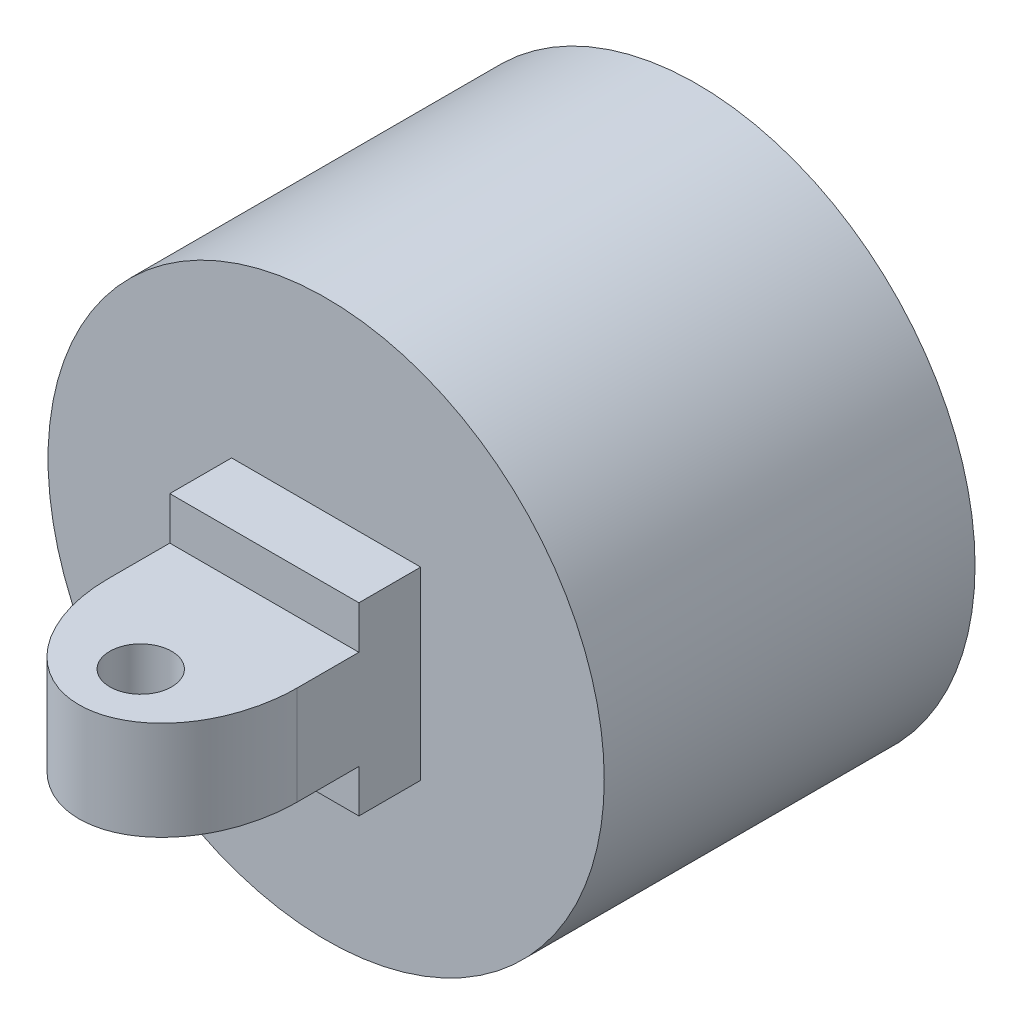
ISO-10303-21;
HEADER;
FILE_DESCRIPTION(('STEP AP214'),'2;1');
FILE_NAME('part.step','',(''),(''),'','','');
FILE_SCHEMA(('AUTOMOTIVE_DESIGN { 1 0 10303 214 1 1 1 1 }'));
ENDSEC;
DATA;
#1=APPLICATION_CONTEXT('core data for automotive mechanical design processes');
#2=APPLICATION_PROTOCOL_DEFINITION('international standard','automotive_design',2000,#1);
#3=PRODUCT_CONTEXT('',#1,'mechanical');
#4=PRODUCT('Part','Part','',(#3));
#5=PRODUCT_RELATED_PRODUCT_CATEGORY('part','',(#4));
#6=PRODUCT_DEFINITION_FORMATION('','',#4);
#7=PRODUCT_DEFINITION_CONTEXT('part definition',#1,'design');
#8=PRODUCT_DEFINITION('design','',#6,#7);
#9=PRODUCT_DEFINITION_SHAPE('','',#8);
#10=(LENGTH_UNIT() NAMED_UNIT(*) SI_UNIT(.MILLI.,.METRE.));
#11=(NAMED_UNIT(*) PLANE_ANGLE_UNIT() SI_UNIT($,.RADIAN.));
#12=(NAMED_UNIT(*) SI_UNIT($,.STERADIAN.) SOLID_ANGLE_UNIT());
#13=UNCERTAINTY_MEASURE_WITH_UNIT(LENGTH_MEASURE(1.E-05),#10,'distance_accuracy_value','');
#14=(GEOMETRIC_REPRESENTATION_CONTEXT(3) GLOBAL_UNCERTAINTY_ASSIGNED_CONTEXT((#13)) GLOBAL_UNIT_ASSIGNED_CONTEXT((#10,
#11,#12)) REPRESENTATION_CONTEXT('',''));
#15=CARTESIAN_POINT('',(0.,0.,0.));
#16=DIRECTION('',(0.,0.,1.));
#17=DIRECTION('',(1.,0.,0.));
#18=AXIS2_PLACEMENT_3D('',#15,#16,#17);
#19=CARTESIAN_POINT('',(0.,-12.5309360047283,45.));
#20=DIRECTION('',(0.,1.,0.));
#21=DIRECTION('',(0.,0.,1.));
#22=AXIS2_PLACEMENT_3D('',#19,#20,#21);
#23=CYLINDRICAL_SURFACE('',#22,2.5);
#24=CARTESIAN_POINT('',(0.,4.,45.));
#25=DIRECTION('',(0.,1.,0.));
#26=DIRECTION('',(0.,0.,1.));
#27=AXIS2_PLACEMENT_3D('',#24,#25,#26);
#28=CIRCLE('',#27,2.5);
#29=CARTESIAN_POINT('',(0.,4.,47.5));
#30=VERTEX_POINT('',#29);
#31=EDGE_CURVE('E496',#30,#30,#28,.F.);
#32=ORIENTED_EDGE('',*,*,#31,.F.);
#33=EDGE_LOOP('',(#32));
#34=FACE_BOUND('',#33,.T.);
#35=CARTESIAN_POINT('',(0.,-3.99906399527171,45.));
#36=DIRECTION('',(0.,-1.,0.));
#37=DIRECTION('',(0.,0.,-1.));
#38=AXIS2_PLACEMENT_3D('',#35,#36,#37);
#39=CIRCLE('',#38,2.5);
#40=CARTESIAN_POINT('',(0.,-3.99906399527171,42.5));
#41=VERTEX_POINT('',#40);
#42=EDGE_CURVE('E490',#41,#41,#39,.F.);
#43=ORIENTED_EDGE('',*,*,#42,.F.);
#44=EDGE_LOOP('',(#43));
#45=FACE_BOUND('',#44,.T.);
#46=ADVANCED_FACE('F300',(#34,#45),#23,.F.);
#47=CARTESIAN_POINT('',(0.,-12.5309360047283,40.));
#48=DIRECTION('',(0.,1.,0.));
#49=DIRECTION('',(0.,0.,-1.));
#50=AXIS2_PLACEMENT_3D('',#47,#48,#49);
#51=ELLIPSE('',#50,10.,7.64976715644752);
#52=DIRECTION('',(0.,1.,0.));
#53=VECTOR('',#52,1.);
#54=SURFACE_OF_LINEAR_EXTRUSION('',#51,#53);
#55=DIRECTION('',(0.,1.,0.));
#56=VECTOR('',#55,1.);
#57=CARTESIAN_POINT('',(-7.64976715644752,-12.5309360047283,40.));
#58=LINE('',#57,#56);
#59=CARTESIAN_POINT('',(-7.64976715644752,-3.99906399527171,40.));
#60=VERTEX_POINT('',#59);
#61=CARTESIAN_POINT('',(-7.64976715644752,4.,40.));
#62=VERTEX_POINT('',#61);
#63=EDGE_CURVE('E309',#60,#62,#58,.T.);
#64=ORIENTED_EDGE('',*,*,#63,.F.);
#65=CARTESIAN_POINT('',(0.,-3.99906399527171,40.));
#66=DIRECTION('',(0.,1.,0.));
#67=DIRECTION('',(0.,0.,-1.));
#68=AXIS2_PLACEMENT_3D('',#65,#66,#67);
#69=ELLIPSE('',#68,10.,7.64976715644752);
#70=CARTESIAN_POINT('',(7.64976715644752,-3.99906399527171,40.));
#71=VERTEX_POINT('',#70);
#72=EDGE_CURVE('E14',#60,#71,#69,.T.);
#73=ORIENTED_EDGE('',*,*,#72,.T.);
#74=DIRECTION('',(0.,1.,0.));
#75=VECTOR('',#74,1.);
#76=CARTESIAN_POINT('',(7.64976715644752,-12.5309360047283,40.));
#77=LINE('',#76,#75);
#78=CARTESIAN_POINT('',(7.64976715644752,4.,40.));
#79=VERTEX_POINT('',#78);
#80=EDGE_CURVE('E517',#71,#79,#77,.T.);
#81=ORIENTED_EDGE('',*,*,#80,.T.);
#82=CARTESIAN_POINT('',(0.,4.,40.));
#83=DIRECTION('',(0.,1.,0.));
#84=DIRECTION('',(0.,0.,-1.));
#85=AXIS2_PLACEMENT_3D('',#82,#83,#84);
#86=ELLIPSE('',#85,10.,7.64976715644752);
#87=EDGE_CURVE('E500',#62,#79,#86,.T.);
#88=ORIENTED_EDGE('',*,*,#87,.F.);
#89=EDGE_LOOP('',(#64,#73,#81,#88));
#90=FACE_BOUND('',#89,.T.);
#91=ADVANCED_FACE('F522',(#90),#54,.T.);
#92=CARTESIAN_POINT('',(7.64976715644752,7.46906399527171,50.));
#93=DIRECTION('',(0.,-1.,0.));
#94=DIRECTION('',(0.,0.,-1.));
#95=AXIS2_PLACEMENT_3D('',#92,#93,#94);
#96=PLANE('',#95);
#97=DIRECTION('',(-1.,0.,0.));
#98=VECTOR('',#97,1.);
#99=CARTESIAN_POINT('',(7.64976715644752,7.46906399527171,35.));
#100=LINE('',#99,#98);
#101=CARTESIAN_POINT('',(7.64976715644752,7.46906399527171,35.));
#102=VERTEX_POINT('',#101);
#103=CARTESIAN_POINT('',(-7.64976715644752,7.46906399527171,35.));
#104=VERTEX_POINT('',#103);
#105=EDGE_CURVE('E514',#102,#104,#100,.T.);
#106=ORIENTED_EDGE('',*,*,#105,.F.);
#107=DIRECTION('',(0.,0.,-1.));
#108=VECTOR('',#107,1.);
#109=CARTESIAN_POINT('',(7.64976715644752,7.46906399527171,50.));
#110=LINE('',#109,#108);
#111=CARTESIAN_POINT('',(7.64976715644752,7.46906399527171,30.));
#112=VERTEX_POINT('',#111);
#113=EDGE_CURVE('E676',#102,#112,#110,.T.);
#114=ORIENTED_EDGE('',*,*,#113,.T.);
#115=DIRECTION('',(-1.,0.,0.));
#116=VECTOR('',#115,1.);
#117=CARTESIAN_POINT('',(7.64976715644752,7.46906399527171,30.));
#118=LINE('',#117,#116);
#119=CARTESIAN_POINT('',(-7.64976715644752,7.46906399527171,30.));
#120=VERTEX_POINT('',#119);
#121=EDGE_CURVE('E669',#112,#120,#118,.T.);
#122=ORIENTED_EDGE('',*,*,#121,.T.);
#123=DIRECTION('',(0.,0.,-1.));
#124=VECTOR('',#123,1.);
#125=CARTESIAN_POINT('',(-7.64976715644752,7.46906399527171,50.));
#126=LINE('',#125,#124);
#127=EDGE_CURVE('E673',#104,#120,#126,.T.);
#128=ORIENTED_EDGE('',*,*,#127,.F.);
#129=EDGE_LOOP('',(#106,#114,#122,#128));
#130=FACE_BOUND('',#129,.T.);
#131=ADVANCED_FACE('F526',(#130),#96,.F.);
#132=CARTESIAN_POINT('',(7.64976715644752,-7.46906399527171,50.));
#133=DIRECTION('',(-1.,0.,0.));
#134=DIRECTION('',(0.,0.,1.));
#135=AXIS2_PLACEMENT_3D('',#132,#133,#134);
#136=PLANE('',#135);
#137=DIRECTION('',(0.,0.,1.));
#138=VECTOR('',#137,1.);
#139=CARTESIAN_POINT('',(7.64976715644752,-3.99906399527171,50.));
#140=LINE('',#139,#138);
#141=CARTESIAN_POINT('',(7.64976715644752,-3.99906399527171,35.));
#142=VERTEX_POINT('',#141);
#143=EDGE_CURVE('E316',#142,#71,#140,.T.);
#144=ORIENTED_EDGE('',*,*,#143,.F.);
#145=DIRECTION('',(0.,-1.,0.));
#146=VECTOR('',#145,1.);
#147=CARTESIAN_POINT('',(7.64976715644752,-7.46906399527171,35.));
#148=LINE('',#147,#146);
#149=CARTESIAN_POINT('',(7.64976715644752,-7.46906399527171,35.));
#150=VERTEX_POINT('',#149);
#151=EDGE_CURVE('E468',#142,#150,#148,.T.);
#152=ORIENTED_EDGE('',*,*,#151,.T.);
#153=DIRECTION('',(0.,0.,-1.));
#154=VECTOR('',#153,1.);
#155=CARTESIAN_POINT('',(7.64976715644752,-7.46906399527171,50.));
#156=LINE('',#155,#154);
#157=CARTESIAN_POINT('',(7.64976715644752,-7.46906399527171,30.));
#158=VERTEX_POINT('',#157);
#159=EDGE_CURVE('E679',#150,#158,#156,.T.);
#160=ORIENTED_EDGE('',*,*,#159,.T.);
#161=DIRECTION('',(0.,1.,0.));
#162=VECTOR('',#161,1.);
#163=CARTESIAN_POINT('',(7.64976715644752,-7.46906399527171,30.));
#164=LINE('',#163,#162);
#165=EDGE_CURVE('E665',#158,#112,#164,.T.);
#166=ORIENTED_EDGE('',*,*,#165,.T.);
#167=ORIENTED_EDGE('',*,*,#113,.F.);
#168=DIRECTION('',(0.,-1.,0.));
#169=VECTOR('',#168,1.);
#170=CARTESIAN_POINT('',(7.64976715644752,-7.46906399527171,35.));
#171=LINE('',#170,#169);
#172=CARTESIAN_POINT('',(7.64976715644752,4.,35.));
#173=VERTEX_POINT('',#172);
#174=EDGE_CURVE('E637',#102,#173,#171,.T.);
#175=ORIENTED_EDGE('',*,*,#174,.T.);
#176=DIRECTION('',(0.,0.,-1.));
#177=VECTOR('',#176,1.);
#178=CARTESIAN_POINT('',(7.64976715644752,3.99999999999999,0.));
#179=LINE('',#178,#177);
#180=EDGE_CURVE('E504',#79,#173,#179,.T.);
#181=ORIENTED_EDGE('',*,*,#180,.F.);
#182=ORIENTED_EDGE('',*,*,#80,.F.);
#183=EDGE_LOOP('',(#144,#152,#160,#166,#167,#175,#181,#182));
#184=FACE_BOUND('',#183,.T.);
#185=ADVANCED_FACE('F541',(#184),#136,.F.);
#186=CARTESIAN_POINT('',(-7.64976715644752,-7.46906399527171,50.));
#187=DIRECTION('',(1.,0.,0.));
#188=DIRECTION('',(0.,0.,-1.));
#189=AXIS2_PLACEMENT_3D('',#186,#187,#188);
#190=PLANE('',#189);
#191=DIRECTION('',(0.,0.,-1.));
#192=VECTOR('',#191,1.);
#193=CARTESIAN_POINT('',(-7.64976715644752,-7.46906399527171,50.));
#194=LINE('',#193,#192);
#195=CARTESIAN_POINT('',(-7.64976715644752,-7.46906399527171,35.));
#196=VERTEX_POINT('',#195);
#197=CARTESIAN_POINT('',(-7.64976715644752,-7.46906399527171,30.));
#198=VERTEX_POINT('',#197);
#199=EDGE_CURVE('E482',#196,#198,#194,.T.);
#200=ORIENTED_EDGE('',*,*,#199,.F.);
#201=DIRECTION('',(0.,-1.,0.));
#202=VECTOR('',#201,1.);
#203=CARTESIAN_POINT('',(-7.64976715644752,0.,35.));
#204=LINE('',#203,#202);
#205=CARTESIAN_POINT('',(-7.64976715644752,-3.99906399527171,35.));
#206=VERTEX_POINT('',#205);
#207=EDGE_CURVE('E465',#206,#196,#204,.T.);
#208=ORIENTED_EDGE('',*,*,#207,.F.);
#209=DIRECTION('',(0.,0.,1.));
#210=VECTOR('',#209,1.);
#211=CARTESIAN_POINT('',(-7.64976715644752,-3.99906399527171,0.));
#212=LINE('',#211,#210);
#213=EDGE_CURVE('E473',#206,#60,#212,.T.);
#214=ORIENTED_EDGE('',*,*,#213,.T.);
#215=ORIENTED_EDGE('',*,*,#63,.T.);
#216=DIRECTION('',(0.,0.,1.));
#217=VECTOR('',#216,1.);
#218=CARTESIAN_POINT('',(-7.64976715644752,3.99999999999999,0.));
#219=LINE('',#218,#217);
#220=CARTESIAN_POINT('',(-7.64976715644752,4.,35.));
#221=VERTEX_POINT('',#220);
#222=EDGE_CURVE('E510',#221,#62,#219,.T.);
#223=ORIENTED_EDGE('',*,*,#222,.F.);
#224=DIRECTION('',(0.,-1.,0.));
#225=VECTOR('',#224,1.);
#226=CARTESIAN_POINT('',(-7.64976715644752,-4.,35.));
#227=LINE('',#226,#225);
#228=EDGE_CURVE('E323',#104,#221,#227,.T.);
#229=ORIENTED_EDGE('',*,*,#228,.F.);
#230=ORIENTED_EDGE('',*,*,#127,.T.);
#231=DIRECTION('',(0.,-1.,0.));
#232=VECTOR('',#231,1.);
#233=CARTESIAN_POINT('',(-7.64976715644752,-7.46906399527171,30.));
#234=LINE('',#233,#232);
#235=EDGE_CURVE('E657',#120,#198,#234,.T.);
#236=ORIENTED_EDGE('',*,*,#235,.T.);
#237=EDGE_LOOP('',(#200,#208,#214,#215,#223,#229,#230,#236));
#238=FACE_BOUND('',#237,.T.);
#239=ADVANCED_FACE('F480',(#238),#190,.F.);
#240=CARTESIAN_POINT('',(7.64976715644752,-7.46906399527171,50.));
#241=DIRECTION('',(0.,1.,0.));
#242=DIRECTION('',(0.,0.,1.));
#243=AXIS2_PLACEMENT_3D('',#240,#241,#242);
#244=PLANE('',#243);
#245=ORIENTED_EDGE('',*,*,#159,.F.);
#246=DIRECTION('',(-1.,0.,0.));
#247=VECTOR('',#246,1.);
#248=CARTESIAN_POINT('',(13.3502328435525,-7.46906399527171,35.));
#249=LINE('',#248,#247);
#250=EDGE_CURVE('E470',#150,#196,#249,.T.);
#251=ORIENTED_EDGE('',*,*,#250,.T.);
#252=ORIENTED_EDGE('',*,*,#199,.T.);
#253=DIRECTION('',(1.,0.,0.));
#254=VECTOR('',#253,1.);
#255=CARTESIAN_POINT('',(7.64976715644752,-7.46906399527171,30.));
#256=LINE('',#255,#254);
#257=EDGE_CURVE('E659',#198,#158,#256,.T.);
#258=ORIENTED_EDGE('',*,*,#257,.T.);
#259=EDGE_LOOP('',(#245,#251,#252,#258));
#260=FACE_BOUND('',#259,.T.);
#261=ADVANCED_FACE('F546',(#260),#244,.F.);
#262=CARTESIAN_POINT('',(0.,0.,30.));
#263=DIRECTION('',(0.,0.,-1.));
#264=DIRECTION('',(-1.,0.,0.));
#265=AXIS2_PLACEMENT_3D('',#262,#263,#264);
#266=CYLINDRICAL_SURFACE('',#265,22.5);
#267=CARTESIAN_POINT('',(0.,0.,30.));
#268=DIRECTION('',(0.,0.,1.));
#269=DIRECTION('',(1.,0.,0.));
#270=AXIS2_PLACEMENT_3D('',#267,#268,#269);
#271=CIRCLE('',#270,22.5);
#272=CARTESIAN_POINT('',(22.5,0.,30.));
#273=VERTEX_POINT('',#272);
#274=EDGE_CURVE('E631',#273,#273,#271,.T.);
#275=ORIENTED_EDGE('',*,*,#274,.F.);
#276=EDGE_LOOP('',(#275));
#277=FACE_BOUND('',#276,.T.);
#278=CARTESIAN_POINT('',(0.,0.,0.));
#279=DIRECTION('',(0.,0.,1.));
#280=DIRECTION('',(1.,0.,0.));
#281=AXIS2_PLACEMENT_3D('',#278,#279,#280);
#282=CIRCLE('',#281,22.5);
#283=CARTESIAN_POINT('',(22.5,0.,0.));
#284=VERTEX_POINT('',#283);
#285=EDGE_CURVE('E628',#284,#284,#282,.T.);
#286=ORIENTED_EDGE('',*,*,#285,.T.);
#287=EDGE_LOOP('',(#286));
#288=FACE_BOUND('',#287,.T.);
#289=ADVANCED_FACE('F302',(#277,#288),#266,.T.);
#290=CARTESIAN_POINT('',(0.,0.,30.));
#291=DIRECTION('',(0.,0.,1.));
#292=DIRECTION('',(1.,0.,0.));
#293=AXIS2_PLACEMENT_3D('',#290,#291,#292);
#294=PLANE('',#293);
#295=ORIENTED_EDGE('',*,*,#235,.F.);
#296=ORIENTED_EDGE('',*,*,#121,.F.);
#297=ORIENTED_EDGE('',*,*,#165,.F.);
#298=ORIENTED_EDGE('',*,*,#257,.F.);
#299=EDGE_LOOP('',(#295,#296,#297,#298));
#300=FACE_BOUND('',#299,.T.);
#301=ORIENTED_EDGE('',*,*,#274,.T.);
#302=EDGE_LOOP('',(#301));
#303=FACE_BOUND('',#302,.T.);
#304=ADVANCED_FACE('F613',(#300,#303),#294,.T.);
#305=CARTESIAN_POINT('',(0.,0.,0.));
#306=DIRECTION('',(0.,0.,1.));
#307=DIRECTION('',(1.,0.,0.));
#308=AXIS2_PLACEMENT_3D('',#305,#306,#307);
#309=PLANE('',#308);
#310=DIRECTION('',(0.,1.,0.));
#311=VECTOR('',#310,1.);
#312=CARTESIAN_POINT('',(-1.5,0.,0.));
#313=LINE('',#312,#311);
#314=CARTESIAN_POINT('',(-1.50000000000003,7.34846922834953,0.));
#315=VERTEX_POINT('',#314);
#316=CARTESIAN_POINT('',(-1.50000000000005,15.,0.));
#317=VERTEX_POINT('',#316);
#318=EDGE_CURVE('E625',#315,#317,#313,.T.);
#319=ORIENTED_EDGE('',*,*,#318,.F.);
#320=CARTESIAN_POINT('',(0.,0.,0.));
#321=DIRECTION('',(0.,0.,-1.));
#322=DIRECTION('',(-1.,0.,0.));
#323=AXIS2_PLACEMENT_3D('',#320,#321,#322);
#324=CIRCLE('',#323,7.5);
#325=CARTESIAN_POINT('',(-7.34846922834953,1.5,0.));
#326=VERTEX_POINT('',#325);
#327=EDGE_CURVE('E715',#326,#315,#324,.T.);
#328=ORIENTED_EDGE('',*,*,#327,.F.);
#329=DIRECTION('',(1.,0.,0.));
#330=VECTOR('',#329,1.);
#331=CARTESIAN_POINT('',(-15.,1.5,0.));
#332=LINE('',#331,#330);
#333=CARTESIAN_POINT('',(-15.,1.5,0.));
#334=VERTEX_POINT('',#333);
#335=EDGE_CURVE('E791',#334,#326,#332,.T.);
#336=ORIENTED_EDGE('',*,*,#335,.F.);
#337=DIRECTION('',(0.,1.,0.));
#338=VECTOR('',#337,1.);
#339=CARTESIAN_POINT('',(-15.,-1.5,0.));
#340=LINE('',#339,#338);
#341=CARTESIAN_POINT('',(-15.,-1.5,0.));
#342=VERTEX_POINT('',#341);
#343=EDGE_CURVE('E785',#342,#334,#340,.T.);
#344=ORIENTED_EDGE('',*,*,#343,.F.);
#345=DIRECTION('',(1.,0.,0.));
#346=VECTOR('',#345,1.);
#347=CARTESIAN_POINT('',(-15.,-1.5,0.));
#348=LINE('',#347,#346);
#349=CARTESIAN_POINT('',(-7.34846922834953,-1.5,0.));
#350=VERTEX_POINT('',#349);
#351=EDGE_CURVE('E770',#342,#350,#348,.T.);
#352=ORIENTED_EDGE('',*,*,#351,.T.);
#353=CARTESIAN_POINT('',(0.,0.,0.));
#354=DIRECTION('',(0.,0.,-1.));
#355=DIRECTION('',(-1.,0.,0.));
#356=AXIS2_PLACEMENT_3D('',#353,#354,#355);
#357=CIRCLE('',#356,7.5);
#358=CARTESIAN_POINT('',(-1.49999999999998,-7.34846922834954,0.));
#359=VERTEX_POINT('',#358);
#360=EDGE_CURVE('E756',#359,#350,#357,.T.);
#361=ORIENTED_EDGE('',*,*,#360,.F.);
#362=DIRECTION('',(0.,1.,0.));
#363=VECTOR('',#362,1.);
#364=CARTESIAN_POINT('',(-1.49999999999995,-15.,0.));
#365=LINE('',#364,#363);
#366=CARTESIAN_POINT('',(-1.49999999999995,-15.,0.));
#367=VERTEX_POINT('',#366);
#368=EDGE_CURVE('E831',#367,#359,#365,.T.);
#369=ORIENTED_EDGE('',*,*,#368,.F.);
#370=DIRECTION('',(-1.,0.,0.));
#371=VECTOR('',#370,1.);
#372=CARTESIAN_POINT('',(1.50000000000005,-15.,0.));
#373=LINE('',#372,#371);
#374=CARTESIAN_POINT('',(1.50000000000005,-15.,0.));
#375=VERTEX_POINT('',#374);
#376=EDGE_CURVE('E684',#375,#367,#373,.T.);
#377=ORIENTED_EDGE('',*,*,#376,.F.);
#378=DIRECTION('',(0.,1.,0.));
#379=VECTOR('',#378,1.);
#380=CARTESIAN_POINT('',(1.50000000000005,-15.,0.));
#381=LINE('',#380,#379);
#382=CARTESIAN_POINT('',(1.50000000000002,-7.34846922834953,0.));
#383=VERTEX_POINT('',#382);
#384=EDGE_CURVE('E819',#375,#383,#381,.T.);
#385=ORIENTED_EDGE('',*,*,#384,.T.);
#386=CARTESIAN_POINT('',(0.,0.,0.));
#387=DIRECTION('',(0.,0.,-1.));
#388=DIRECTION('',(-1.,0.,0.));
#389=AXIS2_PLACEMENT_3D('',#386,#387,#388);
#390=CIRCLE('',#389,7.5);
#391=CARTESIAN_POINT('',(7.34846922834953,-1.5,0.));
#392=VERTEX_POINT('',#391);
#393=EDGE_CURVE('E742',#392,#383,#390,.T.);
#394=ORIENTED_EDGE('',*,*,#393,.F.);
#395=CARTESIAN_POINT('',(15.,-1.5,0.));
#396=VERTEX_POINT('',#395);
#397=EDGE_CURVE('E799',#392,#396,#348,.T.);
#398=ORIENTED_EDGE('',*,*,#397,.T.);
#399=DIRECTION('',(0.,1.,0.));
#400=VECTOR('',#399,1.);
#401=CARTESIAN_POINT('',(15.,-1.5,0.));
#402=LINE('',#401,#400);
#403=CARTESIAN_POINT('',(15.,1.5,0.));
#404=VERTEX_POINT('',#403);
#405=EDGE_CURVE('E795',#396,#404,#402,.T.);
#406=ORIENTED_EDGE('',*,*,#405,.T.);
#407=CARTESIAN_POINT('',(7.34846922834953,1.5,0.));
#408=VERTEX_POINT('',#407);
#409=EDGE_CURVE('E789',#408,#404,#332,.T.);
#410=ORIENTED_EDGE('',*,*,#409,.F.);
#411=CARTESIAN_POINT('',(0.,0.,0.));
#412=DIRECTION('',(0.,0.,-1.));
#413=DIRECTION('',(-1.,0.,0.));
#414=AXIS2_PLACEMENT_3D('',#411,#412,#413);
#415=CIRCLE('',#414,7.5);
#416=CARTESIAN_POINT('',(1.49999999999997,7.34846922834954,0.));
#417=VERTEX_POINT('',#416);
#418=EDGE_CURVE('E710',#417,#408,#415,.T.);
#419=ORIENTED_EDGE('',*,*,#418,.F.);
#420=DIRECTION('',(0.,1.,0.));
#421=VECTOR('',#420,1.);
#422=CARTESIAN_POINT('',(1.5,0.,0.));
#423=LINE('',#422,#421);
#424=CARTESIAN_POINT('',(1.49999999999995,15.,0.));
#425=VERTEX_POINT('',#424);
#426=EDGE_CURVE('E706',#417,#425,#423,.T.);
#427=ORIENTED_EDGE('',*,*,#426,.T.);
#428=DIRECTION('',(-1.,0.,0.));
#429=VECTOR('',#428,1.);
#430=CARTESIAN_POINT('',(0.,15.,0.));
#431=LINE('',#430,#429);
#432=EDGE_CURVE('E690',#425,#317,#431,.T.);
#433=ORIENTED_EDGE('',*,*,#432,.T.);
#434=EDGE_LOOP('',(#319,#328,#336,#344,#352,#361,#369,#377,#385,#394,#398,#406,#410,#419,#427,#433));
#435=FACE_BOUND('',#434,.T.);
#436=ORIENTED_EDGE('',*,*,#285,.F.);
#437=EDGE_LOOP('',(#436));
#438=FACE_BOUND('',#437,.T.);
#439=ADVANCED_FACE('F565',(#435,#438),#309,.F.);
#440=CARTESIAN_POINT('',(-1.5,0.,10.));
#441=DIRECTION('',(-1.,0.,0.));
#442=DIRECTION('',(0.,-1.,0.));
#443=AXIS2_PLACEMENT_3D('',#440,#441,#442);
#444=PLANE('',#443);
#445=ORIENTED_EDGE('',*,*,#318,.T.);
#446=DIRECTION('',(0.,0.,-1.));
#447=VECTOR('',#446,1.);
#448=CARTESIAN_POINT('',(-1.50000000000005,15.,10.));
#449=LINE('',#448,#447);
#450=CARTESIAN_POINT('',(-1.50000000000005,15.,10.));
#451=VERTEX_POINT('',#450);
#452=EDGE_CURVE('E640',#451,#317,#449,.T.);
#453=ORIENTED_EDGE('',*,*,#452,.F.);
#454=DIRECTION('',(0.,1.,0.));
#455=VECTOR('',#454,1.);
#456=CARTESIAN_POINT('',(-1.5,0.,10.));
#457=LINE('',#456,#455);
#458=CARTESIAN_POINT('',(-1.50000000000003,7.34846922834953,10.));
#459=VERTEX_POINT('',#458);
#460=EDGE_CURVE('E698',#459,#451,#457,.T.);
#461=ORIENTED_EDGE('',*,*,#460,.F.);
#462=DIRECTION('',(0.,0.,-1.));
#463=VECTOR('',#462,1.);
#464=CARTESIAN_POINT('',(-1.50000000000003,7.34846922834953,10.));
#465=LINE('',#464,#463);
#466=EDGE_CURVE('E725',#459,#315,#465,.T.);
#467=ORIENTED_EDGE('',*,*,#466,.T.);
#468=EDGE_LOOP('',(#445,#453,#461,#467));
#469=FACE_BOUND('',#468,.T.);
#470=ADVANCED_FACE('F557',(#469),#444,.F.);
#471=CARTESIAN_POINT('',(1.5,0.,10.));
#472=DIRECTION('',(-1.,0.,0.));
#473=DIRECTION('',(0.,-1.,0.));
#474=AXIS2_PLACEMENT_3D('',#471,#472,#473);
#475=PLANE('',#474);
#476=ORIENTED_EDGE('',*,*,#426,.F.);
#477=DIRECTION('',(0.,0.,-1.));
#478=VECTOR('',#477,1.);
#479=CARTESIAN_POINT('',(1.49999999999997,7.34846922834954,10.));
#480=LINE('',#479,#478);
#481=CARTESIAN_POINT('',(1.49999999999997,7.34846922834954,10.));
#482=VERTEX_POINT('',#481);
#483=EDGE_CURVE('E705',#482,#417,#480,.T.);
#484=ORIENTED_EDGE('',*,*,#483,.F.);
#485=DIRECTION('',(0.,1.,0.));
#486=VECTOR('',#485,1.);
#487=CARTESIAN_POINT('',(1.5,0.,10.));
#488=LINE('',#487,#486);
#489=CARTESIAN_POINT('',(1.49999999999995,15.,10.));
#490=VERTEX_POINT('',#489);
#491=EDGE_CURVE('E685',#482,#490,#488,.T.);
#492=ORIENTED_EDGE('',*,*,#491,.T.);
#493=DIRECTION('',(0.,0.,-1.));
#494=VECTOR('',#493,1.);
#495=CARTESIAN_POINT('',(1.49999999999995,15.,10.));
#496=LINE('',#495,#494);
#497=EDGE_CURVE('E632',#490,#425,#496,.T.);
#498=ORIENTED_EDGE('',*,*,#497,.T.);
#499=EDGE_LOOP('',(#476,#484,#492,#498));
#500=FACE_BOUND('',#499,.T.);
#501=ADVANCED_FACE('F561',(#500),#475,.T.);
#502=CARTESIAN_POINT('',(0.,15.,10.));
#503=DIRECTION('',(0.,-1.,0.));
#504=DIRECTION('',(1.,0.,0.));
#505=AXIS2_PLACEMENT_3D('',#502,#503,#504);
#506=PLANE('',#505);
#507=ORIENTED_EDGE('',*,*,#432,.F.);
#508=ORIENTED_EDGE('',*,*,#497,.F.);
#509=DIRECTION('',(-1.,0.,0.));
#510=VECTOR('',#509,1.);
#511=CARTESIAN_POINT('',(0.,15.,10.));
#512=LINE('',#511,#510);
#513=EDGE_CURVE('E702',#490,#451,#512,.T.);
#514=ORIENTED_EDGE('',*,*,#513,.T.);
#515=ORIENTED_EDGE('',*,*,#452,.T.);
#516=EDGE_LOOP('',(#507,#508,#514,#515));
#517=FACE_BOUND('',#516,.T.);
#518=ADVANCED_FACE('F538',(#517),#506,.T.);
#519=CARTESIAN_POINT('',(0.,0.,10.));
#520=DIRECTION('',(0.,0.,-1.));
#521=DIRECTION('',(-1.,0.,0.));
#522=AXIS2_PLACEMENT_3D('',#519,#520,#521);
#523=CYLINDRICAL_SURFACE('',#522,7.5);
#524=ORIENTED_EDGE('',*,*,#360,.T.);
#525=DIRECTION('',(0.,0.,-1.));
#526=VECTOR('',#525,1.);
#527=CARTESIAN_POINT('',(-7.34846922834953,-1.5,10.));
#528=LINE('',#527,#526);
#529=CARTESIAN_POINT('',(-7.34846922834953,-1.5,10.));
#530=VERTEX_POINT('',#529);
#531=EDGE_CURVE('E746',#530,#350,#528,.T.);
#532=ORIENTED_EDGE('',*,*,#531,.F.);
#533=CARTESIAN_POINT('',(0.,0.,10.));
#534=DIRECTION('',(0.,0.,-1.));
#535=DIRECTION('',(-1.,0.,0.));
#536=AXIS2_PLACEMENT_3D('',#533,#534,#535);
#537=CIRCLE('',#536,7.5);
#538=CARTESIAN_POINT('',(-1.49999999999998,-7.34846922834954,10.));
#539=VERTEX_POINT('',#538);
#540=EDGE_CURVE('E751',#539,#530,#537,.T.);
#541=ORIENTED_EDGE('',*,*,#540,.F.);
#542=DIRECTION('',(0.,0.,-1.));
#543=VECTOR('',#542,1.);
#544=CARTESIAN_POINT('',(-1.49999999999998,-7.34846922834954,10.));
#545=LINE('',#544,#543);
#546=EDGE_CURVE('E755',#539,#359,#545,.T.);
#547=ORIENTED_EDGE('',*,*,#546,.T.);
#548=EDGE_LOOP('',(#524,#532,#541,#547));
#549=FACE_BOUND('',#548,.T.);
#550=ADVANCED_FACE('F560',(#549),#523,.F.);
#551=CARTESIAN_POINT('',(-1.49999999999995,-15.,10.));
#552=DIRECTION('',(-1.,0.,0.));
#553=DIRECTION('',(0.,-1.,0.));
#554=AXIS2_PLACEMENT_3D('',#551,#552,#553);
#555=PLANE('',#554);
#556=DIRECTION('',(0.,1.,0.));
#557=VECTOR('',#556,1.);
#558=CARTESIAN_POINT('',(-1.49999999999995,-15.,10.));
#559=LINE('',#558,#557);
#560=CARTESIAN_POINT('',(-1.49999999999995,-15.,10.));
#561=VERTEX_POINT('',#560);
#562=EDGE_CURVE('E818',#561,#539,#559,.T.);
#563=ORIENTED_EDGE('',*,*,#562,.F.);
#564=DIRECTION('',(0.,0.,-1.));
#565=VECTOR('',#564,1.);
#566=CARTESIAN_POINT('',(-1.49999999999995,-15.,10.));
#567=LINE('',#566,#565);
#568=EDGE_CURVE('E827',#561,#367,#567,.T.);
#569=ORIENTED_EDGE('',*,*,#568,.T.);
#570=ORIENTED_EDGE('',*,*,#368,.T.);
#571=ORIENTED_EDGE('',*,*,#546,.F.);
#572=EDGE_LOOP('',(#563,#569,#570,#571));
#573=FACE_BOUND('',#572,.T.);
#574=ADVANCED_FACE('F585',(#573),#555,.F.);
#575=CARTESIAN_POINT('',(1.50000000000005,-15.,10.));
#576=DIRECTION('',(0.,-1.,0.));
#577=DIRECTION('',(1.,0.,0.));
#578=AXIS2_PLACEMENT_3D('',#575,#576,#577);
#579=PLANE('',#578);
#580=ORIENTED_EDGE('',*,*,#376,.T.);
#581=ORIENTED_EDGE('',*,*,#568,.F.);
#582=DIRECTION('',(-1.,0.,0.));
#583=VECTOR('',#582,1.);
#584=CARTESIAN_POINT('',(1.50000000000005,-15.,10.));
#585=LINE('',#584,#583);
#586=CARTESIAN_POINT('',(1.50000000000005,-15.,10.));
#587=VERTEX_POINT('',#586);
#588=EDGE_CURVE('E814',#587,#561,#585,.T.);
#589=ORIENTED_EDGE('',*,*,#588,.F.);
#590=DIRECTION('',(0.,0.,-1.));
#591=VECTOR('',#590,1.);
#592=CARTESIAN_POINT('',(1.50000000000005,-15.,10.));
#593=LINE('',#592,#591);
#594=EDGE_CURVE('E790',#587,#375,#593,.T.);
#595=ORIENTED_EDGE('',*,*,#594,.T.);
#596=EDGE_LOOP('',(#580,#581,#589,#595));
#597=FACE_BOUND('',#596,.T.);
#598=ADVANCED_FACE('F605',(#597),#579,.F.);
#599=CARTESIAN_POINT('',(1.50000000000005,-15.,10.));
#600=DIRECTION('',(-1.,0.,0.));
#601=DIRECTION('',(0.,-1.,0.));
#602=AXIS2_PLACEMENT_3D('',#599,#600,#601);
#603=PLANE('',#602);
#604=DIRECTION('',(0.,0.,-1.));
#605=VECTOR('',#604,1.);
#606=CARTESIAN_POINT('',(1.50000000000002,-7.34846922834953,10.));
#607=LINE('',#606,#605);
#608=CARTESIAN_POINT('',(1.50000000000002,-7.34846922834953,10.));
#609=VERTEX_POINT('',#608);
#610=EDGE_CURVE('E711',#609,#383,#607,.T.);
#611=ORIENTED_EDGE('',*,*,#610,.T.);
#612=ORIENTED_EDGE('',*,*,#384,.F.);
#613=ORIENTED_EDGE('',*,*,#594,.F.);
#614=DIRECTION('',(0.,1.,0.));
#615=VECTOR('',#614,1.);
#616=CARTESIAN_POINT('',(1.50000000000005,-15.,10.));
#617=LINE('',#616,#615);
#618=EDGE_CURVE('E823',#587,#609,#617,.T.);
#619=ORIENTED_EDGE('',*,*,#618,.T.);
#620=EDGE_LOOP('',(#611,#612,#613,#619));
#621=FACE_BOUND('',#620,.T.);
#622=ADVANCED_FACE('F581',(#621),#603,.T.);
#623=CARTESIAN_POINT('',(0.,0.,10.));
#624=DIRECTION('',(0.,0.,-1.));
#625=DIRECTION('',(-1.,0.,0.));
#626=AXIS2_PLACEMENT_3D('',#623,#624,#625);
#627=CYLINDRICAL_SURFACE('',#626,7.5);
#628=ORIENTED_EDGE('',*,*,#393,.T.);
#629=ORIENTED_EDGE('',*,*,#610,.F.);
#630=CARTESIAN_POINT('',(0.,0.,10.));
#631=DIRECTION('',(0.,0.,-1.));
#632=DIRECTION('',(-1.,0.,0.));
#633=AXIS2_PLACEMENT_3D('',#630,#631,#632);
#634=CIRCLE('',#633,7.5);
#635=CARTESIAN_POINT('',(7.34846922834953,-1.5,10.));
#636=VERTEX_POINT('',#635);
#637=EDGE_CURVE('E737',#636,#609,#634,.T.);
#638=ORIENTED_EDGE('',*,*,#637,.F.);
#639=DIRECTION('',(0.,0.,-1.));
#640=VECTOR('',#639,1.);
#641=CARTESIAN_POINT('',(7.34846922834953,-1.5,10.));
#642=LINE('',#641,#640);
#643=EDGE_CURVE('E741',#636,#392,#642,.T.);
#644=ORIENTED_EDGE('',*,*,#643,.T.);
#645=EDGE_LOOP('',(#628,#629,#638,#644));
#646=FACE_BOUND('',#645,.T.);
#647=ADVANCED_FACE('F577',(#646),#627,.F.);
#648=CARTESIAN_POINT('',(-15.,1.5,10.));
#649=DIRECTION('',(0.,1.,0.));
#650=DIRECTION('',(-1.,0.,0.));
#651=AXIS2_PLACEMENT_3D('',#648,#649,#650);
#652=PLANE('',#651);
#653=DIRECTION('',(1.,0.,0.));
#654=VECTOR('',#653,1.);
#655=CARTESIAN_POINT('',(-15.,1.5,10.));
#656=LINE('',#655,#654);
#657=CARTESIAN_POINT('',(-15.,1.5,10.));
#658=VERTEX_POINT('',#657);
#659=CARTESIAN_POINT('',(-7.34846922834953,1.5,10.));
#660=VERTEX_POINT('',#659);
#661=EDGE_CURVE('E771',#658,#660,#656,.T.);
#662=ORIENTED_EDGE('',*,*,#661,.F.);
#663=DIRECTION('',(0.,0.,-1.));
#664=VECTOR('',#663,1.);
#665=CARTESIAN_POINT('',(-15.,1.5,10.));
#666=LINE('',#665,#664);
#667=EDGE_CURVE('E784',#658,#334,#666,.T.);
#668=ORIENTED_EDGE('',*,*,#667,.T.);
#669=ORIENTED_EDGE('',*,*,#335,.T.);
#670=DIRECTION('',(0.,0.,-1.));
#671=VECTOR('',#670,1.);
#672=CARTESIAN_POINT('',(-7.34846922834953,1.5,10.));
#673=LINE('',#672,#671);
#674=EDGE_CURVE('E728',#660,#326,#673,.T.);
#675=ORIENTED_EDGE('',*,*,#674,.F.);
#676=EDGE_LOOP('',(#662,#668,#669,#675));
#677=FACE_BOUND('',#676,.T.);
#678=ADVANCED_FACE('F580',(#677),#652,.F.);
#679=CARTESIAN_POINT('',(-15.,-1.5,10.));
#680=DIRECTION('',(-1.,0.,0.));
#681=DIRECTION('',(0.,0.,1.));
#682=AXIS2_PLACEMENT_3D('',#679,#680,#681);
#683=PLANE('',#682);
#684=ORIENTED_EDGE('',*,*,#343,.T.);
#685=ORIENTED_EDGE('',*,*,#667,.F.);
#686=DIRECTION('',(0.,1.,0.));
#687=VECTOR('',#686,1.);
#688=CARTESIAN_POINT('',(-15.,-1.5,10.));
#689=LINE('',#688,#687);
#690=CARTESIAN_POINT('',(-15.,-1.5,10.));
#691=VERTEX_POINT('',#690);
#692=EDGE_CURVE('E765',#691,#658,#689,.T.);
#693=ORIENTED_EDGE('',*,*,#692,.F.);
#694=DIRECTION('',(0.,0.,-1.));
#695=VECTOR('',#694,1.);
#696=CARTESIAN_POINT('',(-15.,-1.5,10.));
#697=LINE('',#696,#695);
#698=EDGE_CURVE('E760',#691,#342,#697,.T.);
#699=ORIENTED_EDGE('',*,*,#698,.T.);
#700=EDGE_LOOP('',(#684,#685,#693,#699));
#701=FACE_BOUND('',#700,.T.);
#702=ADVANCED_FACE('F591',(#701),#683,.F.);
#703=CARTESIAN_POINT('',(-15.,-1.5,10.));
#704=DIRECTION('',(0.,1.,0.));
#705=DIRECTION('',(-1.,0.,0.));
#706=AXIS2_PLACEMENT_3D('',#703,#704,#705);
#707=PLANE('',#706);
#708=ORIENTED_EDGE('',*,*,#531,.T.);
#709=ORIENTED_EDGE('',*,*,#351,.F.);
#710=ORIENTED_EDGE('',*,*,#698,.F.);
#711=DIRECTION('',(1.,0.,0.));
#712=VECTOR('',#711,1.);
#713=CARTESIAN_POINT('',(-15.,-1.5,10.));
#714=LINE('',#713,#712);
#715=EDGE_CURVE('E780',#691,#530,#714,.T.);
#716=ORIENTED_EDGE('',*,*,#715,.T.);
#717=EDGE_LOOP('',(#708,#709,#710,#716));
#718=FACE_BOUND('',#717,.T.);
#719=ADVANCED_FACE('F587',(#718),#707,.T.);
#720=ORIENTED_EDGE('',*,*,#643,.F.);
#721=CARTESIAN_POINT('',(15.,-1.5,10.));
#722=VERTEX_POINT('',#721);
#723=EDGE_CURVE('E779',#636,#722,#714,.T.);
#724=ORIENTED_EDGE('',*,*,#723,.T.);
#725=DIRECTION('',(0.,0.,-1.));
#726=VECTOR('',#725,1.);
#727=CARTESIAN_POINT('',(15.,-1.5,10.));
#728=LINE('',#727,#726);
#729=EDGE_CURVE('E805',#722,#396,#728,.T.);
#730=ORIENTED_EDGE('',*,*,#729,.T.);
#731=ORIENTED_EDGE('',*,*,#397,.F.);
#732=EDGE_LOOP('',(#720,#724,#730,#731));
#733=FACE_BOUND('',#732,.T.);
#734=ADVANCED_FACE('F590',(#733),#707,.T.);
#735=CARTESIAN_POINT('',(15.,-1.5,10.));
#736=DIRECTION('',(-1.,0.,0.));
#737=DIRECTION('',(0.,0.,1.));
#738=AXIS2_PLACEMENT_3D('',#735,#736,#737);
#739=PLANE('',#738);
#740=ORIENTED_EDGE('',*,*,#405,.F.);
#741=ORIENTED_EDGE('',*,*,#729,.F.);
#742=DIRECTION('',(0.,1.,0.));
#743=VECTOR('',#742,1.);
#744=CARTESIAN_POINT('',(15.,-1.5,10.));
#745=LINE('',#744,#743);
#746=CARTESIAN_POINT('',(15.,1.5,10.));
#747=VERTEX_POINT('',#746);
#748=EDGE_CURVE('E775',#722,#747,#745,.T.);
#749=ORIENTED_EDGE('',*,*,#748,.T.);
#750=DIRECTION('',(0.,0.,-1.));
#751=VECTOR('',#750,1.);
#752=CARTESIAN_POINT('',(15.,1.5,10.));
#753=LINE('',#752,#751);
#754=EDGE_CURVE('E808',#747,#404,#753,.T.);
#755=ORIENTED_EDGE('',*,*,#754,.T.);
#756=EDGE_LOOP('',(#740,#741,#749,#755));
#757=FACE_BOUND('',#756,.T.);
#758=ADVANCED_FACE('F593',(#757),#739,.T.);
#759=ORIENTED_EDGE('',*,*,#409,.T.);
#760=ORIENTED_EDGE('',*,*,#754,.F.);
#761=CARTESIAN_POINT('',(7.34846922834953,1.5,10.));
#762=VERTEX_POINT('',#761);
#763=EDGE_CURVE('E769',#762,#747,#656,.T.);
#764=ORIENTED_EDGE('',*,*,#763,.F.);
#765=DIRECTION('',(0.,0.,-1.));
#766=VECTOR('',#765,1.);
#767=CARTESIAN_POINT('',(7.34846922834953,1.5,10.));
#768=LINE('',#767,#766);
#769=EDGE_CURVE('E731',#762,#408,#768,.T.);
#770=ORIENTED_EDGE('',*,*,#769,.T.);
#771=EDGE_LOOP('',(#759,#760,#764,#770));
#772=FACE_BOUND('',#771,.T.);
#773=ADVANCED_FACE('F569',(#772),#652,.F.);
#774=CARTESIAN_POINT('',(0.,0.,10.));
#775=DIRECTION('',(0.,0.,-1.));
#776=DIRECTION('',(-1.,0.,0.));
#777=AXIS2_PLACEMENT_3D('',#774,#775,#776);
#778=CYLINDRICAL_SURFACE('',#777,7.5);
#779=ORIENTED_EDGE('',*,*,#327,.T.);
#780=ORIENTED_EDGE('',*,*,#466,.F.);
#781=CARTESIAN_POINT('',(0.,0.,10.));
#782=DIRECTION('',(0.,0.,-1.));
#783=DIRECTION('',(-1.,0.,0.));
#784=AXIS2_PLACEMENT_3D('',#781,#782,#783);
#785=CIRCLE('',#784,7.5);
#786=EDGE_CURVE('E694',#660,#459,#785,.T.);
#787=ORIENTED_EDGE('',*,*,#786,.F.);
#788=ORIENTED_EDGE('',*,*,#674,.T.);
#789=EDGE_LOOP('',(#779,#780,#787,#788));
#790=FACE_BOUND('',#789,.T.);
#791=ADVANCED_FACE('F555',(#790),#778,.F.);
#792=CARTESIAN_POINT('',(0.,0.,10.));
#793=DIRECTION('',(0.,0.,-1.));
#794=DIRECTION('',(-1.,0.,0.));
#795=AXIS2_PLACEMENT_3D('',#792,#793,#794);
#796=PLANE('',#795);
#797=ORIENTED_EDGE('',*,*,#786,.T.);
#798=ORIENTED_EDGE('',*,*,#460,.T.);
#799=ORIENTED_EDGE('',*,*,#513,.F.);
#800=ORIENTED_EDGE('',*,*,#491,.F.);
#801=CARTESIAN_POINT('',(0.,0.,10.));
#802=DIRECTION('',(0.,0.,-1.));
#803=DIRECTION('',(-1.,0.,0.));
#804=AXIS2_PLACEMENT_3D('',#801,#802,#803);
#805=CIRCLE('',#804,7.5);
#806=EDGE_CURVE('E689',#482,#762,#805,.T.);
#807=ORIENTED_EDGE('',*,*,#806,.T.);
#808=ORIENTED_EDGE('',*,*,#763,.T.);
#809=ORIENTED_EDGE('',*,*,#748,.F.);
#810=ORIENTED_EDGE('',*,*,#723,.F.);
#811=ORIENTED_EDGE('',*,*,#637,.T.);
#812=ORIENTED_EDGE('',*,*,#618,.F.);
#813=ORIENTED_EDGE('',*,*,#588,.T.);
#814=ORIENTED_EDGE('',*,*,#562,.T.);
#815=ORIENTED_EDGE('',*,*,#540,.T.);
#816=ORIENTED_EDGE('',*,*,#715,.F.);
#817=ORIENTED_EDGE('',*,*,#692,.T.);
#818=ORIENTED_EDGE('',*,*,#661,.T.);
#819=EDGE_LOOP('',(#797,#798,#799,#800,#807,#808,#809,#810,#811,#812,#813,#814,#815,#816,#817,#818));
#820=FACE_BOUND('',#819,.T.);
#821=ADVANCED_FACE('F552',(#820),#796,.T.);
#822=CARTESIAN_POINT('',(0.,0.,10.));
#823=DIRECTION('',(0.,0.,-1.));
#824=DIRECTION('',(-1.,0.,0.));
#825=AXIS2_PLACEMENT_3D('',#822,#823,#824);
#826=CYLINDRICAL_SURFACE('',#825,7.5);
#827=ORIENTED_EDGE('',*,*,#418,.T.);
#828=ORIENTED_EDGE('',*,*,#769,.F.);
#829=ORIENTED_EDGE('',*,*,#806,.F.);
#830=ORIENTED_EDGE('',*,*,#483,.T.);
#831=EDGE_LOOP('',(#827,#828,#829,#830));
#832=FACE_BOUND('',#831,.T.);
#833=ADVANCED_FACE('F536',(#832),#826,.F.);
#834=CARTESIAN_POINT('',(12.3502328435525,-4.,35.));
#835=DIRECTION('',(0.,0.,-1.));
#836=DIRECTION('',(-1.,0.,0.));
#837=AXIS2_PLACEMENT_3D('',#834,#835,#836);
#838=PLANE('',#837);
#839=ORIENTED_EDGE('',*,*,#228,.T.);
#840=DIRECTION('',(-1.,0.,0.));
#841=VECTOR('',#840,1.);
#842=CARTESIAN_POINT('',(0.,4.,35.));
#843=LINE('',#842,#841);
#844=EDGE_CURVE('E507',#173,#221,#843,.T.);
#845=ORIENTED_EDGE('',*,*,#844,.F.);
#846=ORIENTED_EDGE('',*,*,#174,.F.);
#847=ORIENTED_EDGE('',*,*,#105,.T.);
#848=EDGE_LOOP('',(#839,#845,#846,#847));
#849=FACE_BOUND('',#848,.T.);
#850=ADVANCED_FACE('F533',(#849),#838,.F.);
#851=CARTESIAN_POINT('',(0.,3.99999999999999,0.));
#852=DIRECTION('',(0.,1.,0.));
#853=DIRECTION('',(0.,0.,1.));
#854=AXIS2_PLACEMENT_3D('',#851,#852,#853);
#855=PLANE('',#854);
#856=ORIENTED_EDGE('',*,*,#31,.T.);
#857=EDGE_LOOP('',(#856));
#858=FACE_BOUND('',#857,.T.);
#859=ORIENTED_EDGE('',*,*,#87,.T.);
#860=ORIENTED_EDGE('',*,*,#180,.T.);
#861=ORIENTED_EDGE('',*,*,#844,.T.);
#862=ORIENTED_EDGE('',*,*,#222,.T.);
#863=EDGE_LOOP('',(#859,#860,#861,#862));
#864=FACE_BOUND('',#863,.T.);
#865=ADVANCED_FACE('F528',(#858,#864),#855,.T.);
#866=CARTESIAN_POINT('',(13.3502328435525,0.,35.));
#867=DIRECTION('',(0.,0.,-1.));
#868=DIRECTION('',(-1.,0.,0.));
#869=AXIS2_PLACEMENT_3D('',#866,#867,#868);
#870=PLANE('',#869);
#871=DIRECTION('',(-1.,0.,0.));
#872=VECTOR('',#871,1.);
#873=CARTESIAN_POINT('',(13.3502328435525,-3.99906399527171,35.));
#874=LINE('',#873,#872);
#875=EDGE_CURVE('E461',#142,#206,#874,.T.);
#876=ORIENTED_EDGE('',*,*,#875,.T.);
#877=ORIENTED_EDGE('',*,*,#207,.T.);
#878=ORIENTED_EDGE('',*,*,#250,.F.);
#879=ORIENTED_EDGE('',*,*,#151,.F.);
#880=EDGE_LOOP('',(#876,#877,#878,#879));
#881=FACE_BOUND('',#880,.T.);
#882=ADVANCED_FACE('F463',(#881),#870,.F.);
#883=CARTESIAN_POINT('',(13.3502328435525,-3.99906399527171,0.));
#884=DIRECTION('',(0.,-1.,0.));
#885=DIRECTION('',(0.,0.,-1.));
#886=AXIS2_PLACEMENT_3D('',#883,#884,#885);
#887=PLANE('',#886);
#888=ORIENTED_EDGE('',*,*,#143,.T.);
#889=ORIENTED_EDGE('',*,*,#72,.F.);
#890=ORIENTED_EDGE('',*,*,#213,.F.);
#891=ORIENTED_EDGE('',*,*,#875,.F.);
#892=EDGE_LOOP('',(#888,#889,#890,#891));
#893=FACE_BOUND('',#892,.T.);
#894=ORIENTED_EDGE('',*,*,#42,.T.);
#895=EDGE_LOOP('',(#894));
#896=FACE_BOUND('',#895,.T.);
#897=ADVANCED_FACE('F474',(#893,#896),#887,.T.);
#898=CLOSED_SHELL('',(#46,#91,#131,#185,#239,#261,#289,#304,#439,#470,#501,#518,#550,#574,#598,
#622,#647,#678,#702,#719,#734,#758,#773,#791,#821,#833,#850,#865,#882,#897));
#899=MANIFOLD_SOLID_BREP('B2',#898);
#900=ADVANCED_BREP_SHAPE_REPRESENTATION('',(#18,#899),#14);
#901=SHAPE_DEFINITION_REPRESENTATION(#9,#900);
ENDSEC;
END-ISO-10303-21;
